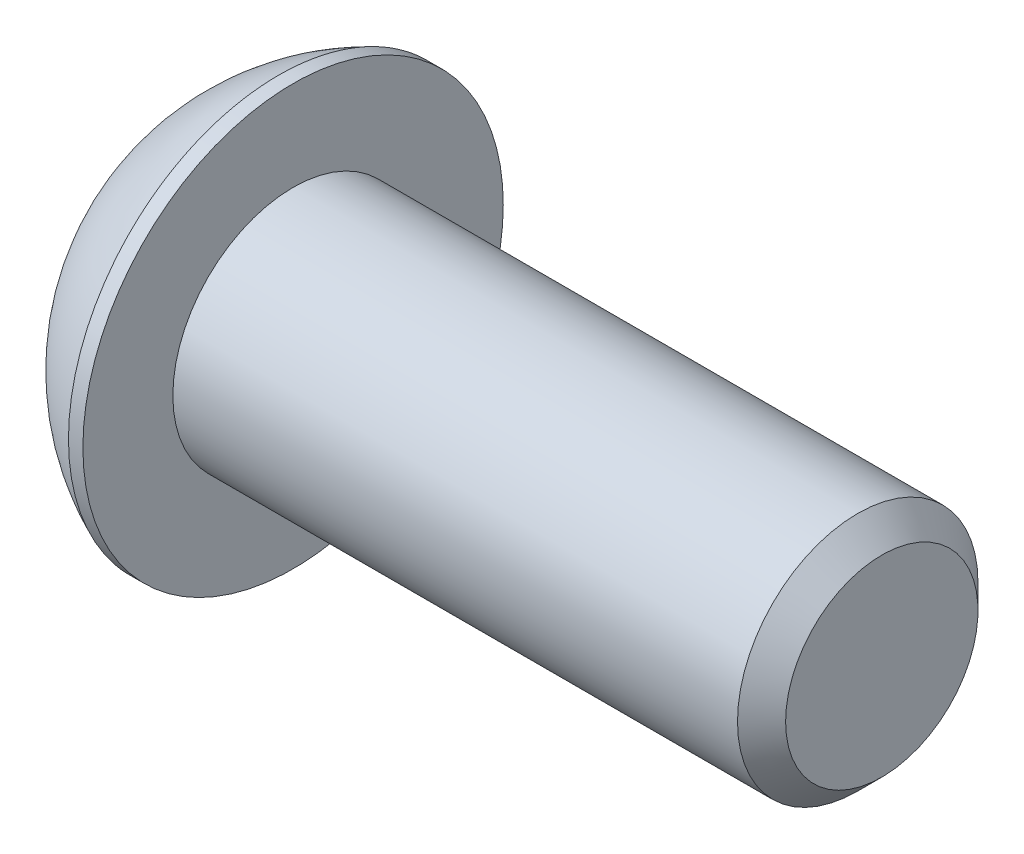
ISO-10303-21;
HEADER;
FILE_DESCRIPTION(('STEP AP214'),'2;1');
FILE_NAME('part.step','',(''),(''),'','','');
FILE_SCHEMA(('AUTOMOTIVE_DESIGN { 1 0 10303 214 1 1 1 1 }'));
ENDSEC;
DATA;
#1=APPLICATION_CONTEXT('core data for automotive mechanical design processes');
#2=APPLICATION_PROTOCOL_DEFINITION('international standard','automotive_design',2000,#1);
#3=PRODUCT_CONTEXT('',#1,'mechanical');
#4=PRODUCT('Part','Part','',(#3));
#5=PRODUCT_RELATED_PRODUCT_CATEGORY('part','',(#4));
#6=PRODUCT_DEFINITION_FORMATION('','',#4);
#7=PRODUCT_DEFINITION_CONTEXT('part definition',#1,'design');
#8=PRODUCT_DEFINITION('design','',#6,#7);
#9=PRODUCT_DEFINITION_SHAPE('','',#8);
#10=(LENGTH_UNIT() NAMED_UNIT(*) SI_UNIT(.MILLI.,.METRE.));
#11=(NAMED_UNIT(*) PLANE_ANGLE_UNIT() SI_UNIT($,.RADIAN.));
#12=(NAMED_UNIT(*) SI_UNIT($,.STERADIAN.) SOLID_ANGLE_UNIT());
#13=UNCERTAINTY_MEASURE_WITH_UNIT(LENGTH_MEASURE(1.E-05),#10,'distance_accuracy_value','');
#14=(GEOMETRIC_REPRESENTATION_CONTEXT(3) GLOBAL_UNCERTAINTY_ASSIGNED_CONTEXT((#13)) GLOBAL_UNIT_ASSIGNED_CONTEXT((#10,
#11,#12)) REPRESENTATION_CONTEXT('',''));
#15=CARTESIAN_POINT('',(0.,0.,0.));
#16=DIRECTION('',(0.,0.,1.));
#17=DIRECTION('',(1.,0.,0.));
#18=AXIS2_PLACEMENT_3D('',#15,#16,#17);
#19=CARTESIAN_POINT('',(1.32080000000034,0.,0.));
#20=DIRECTION('',(-1.,0.,0.));
#21=DIRECTION('',(0.,0.,1.));
#22=AXIS2_PLACEMENT_3D('',#19,#20,#21);
#23=CONICAL_SURFACE('',#22,1.1937999999998,1.04719755119608);
#24=CARTESIAN_POINT('',(2.01004075135902,0.,-4.44089209850063E-13));
#25=VERTEX_POINT('',#24);
#26=VERTEX_LOOP('',#25);
#27=FACE_BOUND('',#26,.T.);
#28=CARTESIAN_POINT('',(1.32080000000009,0.,0.));
#29=DIRECTION('',(-1.,0.,0.));
#30=DIRECTION('',(0.,0.,1.));
#31=AXIS2_PLACEMENT_3D('',#28,#29,#30);
#32=CIRCLE('',#31,1.19380000000024);
#33=CARTESIAN_POINT('',(1.32080000000009,0.,1.19380000000024));
#34=VERTEX_POINT('',#33);
#35=EDGE_CURVE('E20',#34,#34,#32,.T.);
#36=ORIENTED_EDGE('',*,*,#35,.T.);
#37=EDGE_LOOP('',(#36));
#38=FACE_BOUND('',#37,.T.);
#39=ADVANCED_FACE('F17',(#27,#38),#23,.F.);
#40=CARTESIAN_POINT('',(1.3208,-2.29135888084633,0.));
#41=DIRECTION('',(1.,0.,0.));
#42=DIRECTION('',(0.,0.,-1.));
#43=AXIS2_PLACEMENT_3D('',#40,#41,#42);
#44=PLANE('',#43);
#45=DIRECTION('',(0.,1.,0.));
#46=VECTOR('',#45,1.);
#47=CARTESIAN_POINT('',(1.3208,-1.14567944042316,1.984375));
#48=LINE('',#47,#46);
#49=CARTESIAN_POINT('',(1.3208,1.14567944042316,1.984375));
#50=VERTEX_POINT('',#49);
#51=CARTESIAN_POINT('',(1.3208,-1.14567944042316,1.984375));
#52=VERTEX_POINT('',#51);
#53=EDGE_CURVE('E69',#50,#52,#48,.F.);
#54=ORIENTED_EDGE('',*,*,#53,.F.);
#55=DIRECTION('',(0.,0.5,-0.866025403784439));
#56=VECTOR('',#55,1.);
#57=CARTESIAN_POINT('',(1.3208,1.14567944042316,1.984375));
#58=LINE('',#57,#56);
#59=CARTESIAN_POINT('',(1.3208,2.29135888084633,0.));
#60=VERTEX_POINT('',#59);
#61=EDGE_CURVE('E293',#60,#50,#58,.F.);
#62=ORIENTED_EDGE('',*,*,#61,.F.);
#63=DIRECTION('',(0.,-0.5,-0.866025403784439));
#64=VECTOR('',#63,1.);
#65=CARTESIAN_POINT('',(1.3208,2.29135888084633,0.));
#66=LINE('',#65,#64);
#67=CARTESIAN_POINT('',(1.3208,1.14567944042316,-1.984375));
#68=VERTEX_POINT('',#67);
#69=EDGE_CURVE('E297',#68,#60,#66,.F.);
#70=ORIENTED_EDGE('',*,*,#69,.F.);
#71=DIRECTION('',(0.,1.,0.));
#72=VECTOR('',#71,1.);
#73=CARTESIAN_POINT('',(1.3208,1.14567944042316,-1.984375));
#74=LINE('',#73,#72);
#75=CARTESIAN_POINT('',(1.3208,-1.14567944042316,-1.984375));
#76=VERTEX_POINT('',#75);
#77=EDGE_CURVE('E302',#76,#68,#74,.T.);
#78=ORIENTED_EDGE('',*,*,#77,.F.);
#79=DIRECTION('',(0.,-0.500000000000001,0.866025403784438));
#80=VECTOR('',#79,1.);
#81=CARTESIAN_POINT('',(1.3208,-1.14567944042316,-1.984375));
#82=LINE('',#81,#80);
#83=CARTESIAN_POINT('',(1.3208,-2.29135888084633,0.));
#84=VERTEX_POINT('',#83);
#85=EDGE_CURVE('E307',#84,#76,#82,.F.);
#86=ORIENTED_EDGE('',*,*,#85,.F.);
#87=DIRECTION('',(0.,0.500000000000001,0.866025403784438));
#88=VECTOR('',#87,1.);
#89=CARTESIAN_POINT('',(1.3208,-2.29135888084633,0.));
#90=LINE('',#89,#88);
#91=EDGE_CURVE('E82',#52,#84,#90,.F.);
#92=ORIENTED_EDGE('',*,*,#91,.F.);
#93=EDGE_LOOP('',(#54,#62,#70,#78,#86,#92));
#94=FACE_BOUND('',#93,.T.);
#95=ORIENTED_EDGE('',*,*,#35,.F.);
#96=EDGE_LOOP('',(#95));
#97=FACE_BOUND('',#96,.T.);
#98=ADVANCED_FACE('F75',(#94,#97),#44,.F.);
#99=CARTESIAN_POINT('',(1.3208,-1.14567944042316,1.984375));
#100=DIRECTION('',(0.,0.,-1.));
#101=DIRECTION('',(0.,1.,0.));
#102=AXIS2_PLACEMENT_3D('',#99,#100,#101);
#103=PLANE('',#102);
#104=ORIENTED_EDGE('',*,*,#53,.T.);
#105=DIRECTION('',(1.,0.,0.));
#106=VECTOR('',#105,1.);
#107=CARTESIAN_POINT('',(1.3208,-1.14567944042316,1.984375));
#108=LINE('',#107,#106);
#109=CARTESIAN_POINT('',(0.,-1.14567944042316,1.984375));
#110=VERTEX_POINT('',#109);
#111=EDGE_CURVE('E79',#110,#52,#108,.T.);
#112=ORIENTED_EDGE('',*,*,#111,.F.);
#113=DIRECTION('',(0.,1.,0.));
#114=VECTOR('',#113,1.);
#115=CARTESIAN_POINT('',(0.,0.,1.984375));
#116=LINE('',#115,#114);
#117=CARTESIAN_POINT('',(0.,1.14567944042316,1.984375));
#118=VERTEX_POINT('',#117);
#119=EDGE_CURVE('E287',#118,#110,#116,.F.);
#120=ORIENTED_EDGE('',*,*,#119,.F.);
#121=DIRECTION('',(1.,0.,0.));
#122=VECTOR('',#121,1.);
#123=CARTESIAN_POINT('',(1.3208,1.14567944042316,1.984375));
#124=LINE('',#123,#122);
#125=EDGE_CURVE('E290',#50,#118,#124,.F.);
#126=ORIENTED_EDGE('',*,*,#125,.F.);
#127=EDGE_LOOP('',(#104,#112,#120,#126));
#128=FACE_BOUND('',#127,.T.);
#129=ADVANCED_FACE('F129',(#128),#103,.T.);
#130=CARTESIAN_POINT('',(1.3208,-2.29135888084633,0.));
#131=DIRECTION('',(0.,0.866025403784438,-0.500000000000001));
#132=DIRECTION('',(0.,0.500000000000001,0.866025403784438));
#133=AXIS2_PLACEMENT_3D('',#130,#131,#132);
#134=PLANE('',#133);
#135=ORIENTED_EDGE('',*,*,#91,.T.);
#136=DIRECTION('',(1.,0.,0.));
#137=VECTOR('',#136,1.);
#138=CARTESIAN_POINT('',(1.3208,-2.29135888084633,0.));
#139=LINE('',#138,#137);
#140=CARTESIAN_POINT('',(0.,-2.29135888084633,0.));
#141=VERTEX_POINT('',#140);
#142=EDGE_CURVE('E309',#141,#84,#139,.T.);
#143=ORIENTED_EDGE('',*,*,#142,.F.);
#144=DIRECTION('',(0.,-0.500000000000001,-0.866025403784438));
#145=VECTOR('',#144,1.);
#146=CARTESIAN_POINT('',(0.,-1.14567944042316,1.984375));
#147=LINE('',#146,#145);
#148=EDGE_CURVE('E284',#110,#141,#147,.T.);
#149=ORIENTED_EDGE('',*,*,#148,.F.);
#150=ORIENTED_EDGE('',*,*,#111,.T.);
#151=EDGE_LOOP('',(#135,#143,#149,#150));
#152=FACE_BOUND('',#151,.T.);
#153=ADVANCED_FACE('F125',(#152),#134,.T.);
#154=CARTESIAN_POINT('',(1.3208,-1.14567944042316,-1.984375));
#155=DIRECTION('',(0.,0.866025403784438,0.500000000000001));
#156=DIRECTION('',(0.,-0.500000000000001,0.866025403784438));
#157=AXIS2_PLACEMENT_3D('',#154,#155,#156);
#158=PLANE('',#157);
#159=ORIENTED_EDGE('',*,*,#85,.T.);
#160=DIRECTION('',(1.,0.,0.));
#161=VECTOR('',#160,1.);
#162=CARTESIAN_POINT('',(1.3208,-1.14567944042316,-1.984375));
#163=LINE('',#162,#161);
#164=CARTESIAN_POINT('',(0.,-1.14567944042316,-1.984375));
#165=VERTEX_POINT('',#164);
#166=EDGE_CURVE('E304',#165,#76,#163,.T.);
#167=ORIENTED_EDGE('',*,*,#166,.F.);
#168=DIRECTION('',(0.,0.500000000000001,-0.866025403784438));
#169=VECTOR('',#168,1.);
#170=CARTESIAN_POINT('',(0.,-2.29135888084633,0.));
#171=LINE('',#170,#169);
#172=EDGE_CURVE('E281',#141,#165,#171,.T.);
#173=ORIENTED_EDGE('',*,*,#172,.F.);
#174=ORIENTED_EDGE('',*,*,#142,.T.);
#175=EDGE_LOOP('',(#159,#167,#173,#174));
#176=FACE_BOUND('',#175,.T.);
#177=ADVANCED_FACE('F121',(#176),#158,.T.);
#178=CARTESIAN_POINT('',(1.3208,1.14567944042316,-1.984375));
#179=DIRECTION('',(0.,0.,1.));
#180=DIRECTION('',(1.,0.,0.));
#181=AXIS2_PLACEMENT_3D('',#178,#179,#180);
#182=PLANE('',#181);
#183=ORIENTED_EDGE('',*,*,#77,.T.);
#184=DIRECTION('',(1.,0.,0.));
#185=VECTOR('',#184,1.);
#186=CARTESIAN_POINT('',(1.3208,1.14567944042316,-1.984375));
#187=LINE('',#186,#185);
#188=CARTESIAN_POINT('',(0.,1.14567944042316,-1.984375));
#189=VERTEX_POINT('',#188);
#190=EDGE_CURVE('E299',#189,#68,#187,.T.);
#191=ORIENTED_EDGE('',*,*,#190,.F.);
#192=DIRECTION('',(0.,1.,0.));
#193=VECTOR('',#192,1.);
#194=CARTESIAN_POINT('',(0.,0.,-1.984375));
#195=LINE('',#194,#193);
#196=EDGE_CURVE('E278',#165,#189,#195,.T.);
#197=ORIENTED_EDGE('',*,*,#196,.F.);
#198=ORIENTED_EDGE('',*,*,#166,.T.);
#199=EDGE_LOOP('',(#183,#191,#197,#198));
#200=FACE_BOUND('',#199,.T.);
#201=ADVANCED_FACE('F118',(#200),#182,.T.);
#202=CARTESIAN_POINT('',(1.3208,2.29135888084633,0.));
#203=DIRECTION('',(0.,-0.866025403784439,0.5));
#204=DIRECTION('',(0.,-0.5,-0.866025403784439));
#205=AXIS2_PLACEMENT_3D('',#202,#203,#204);
#206=PLANE('',#205);
#207=ORIENTED_EDGE('',*,*,#69,.T.);
#208=DIRECTION('',(1.,0.,0.));
#209=VECTOR('',#208,1.);
#210=CARTESIAN_POINT('',(1.3208,2.29135888084633,0.));
#211=LINE('',#210,#209);
#212=CARTESIAN_POINT('',(0.,2.29135888084633,0.));
#213=VERTEX_POINT('',#212);
#214=EDGE_CURVE('E35',#213,#60,#211,.T.);
#215=ORIENTED_EDGE('',*,*,#214,.F.);
#216=DIRECTION('',(0.,0.5,0.866025403784439));
#217=VECTOR('',#216,1.);
#218=CARTESIAN_POINT('',(0.,1.14567944042316,-1.984375));
#219=LINE('',#218,#217);
#220=EDGE_CURVE('E275',#189,#213,#219,.T.);
#221=ORIENTED_EDGE('',*,*,#220,.F.);
#222=ORIENTED_EDGE('',*,*,#190,.T.);
#223=EDGE_LOOP('',(#207,#215,#221,#222));
#224=FACE_BOUND('',#223,.T.);
#225=ADVANCED_FACE('F114',(#224),#206,.T.);
#226=CARTESIAN_POINT('',(1.3208,1.14567944042316,1.984375));
#227=DIRECTION('',(0.,-0.866025403784439,-0.5));
#228=DIRECTION('',(0.,0.5,-0.866025403784439));
#229=AXIS2_PLACEMENT_3D('',#226,#227,#228);
#230=PLANE('',#229);
#231=ORIENTED_EDGE('',*,*,#61,.T.);
#232=ORIENTED_EDGE('',*,*,#125,.T.);
#233=DIRECTION('',(0.,-0.5,0.866025403784438));
#234=VECTOR('',#233,1.);
#235=CARTESIAN_POINT('',(0.,2.29135888084633,0.));
#236=LINE('',#235,#234);
#237=EDGE_CURVE('E101',#213,#118,#236,.T.);
#238=ORIENTED_EDGE('',*,*,#237,.F.);
#239=ORIENTED_EDGE('',*,*,#214,.T.);
#240=EDGE_LOOP('',(#231,#232,#238,#239));
#241=FACE_BOUND('',#240,.T.);
#242=ADVANCED_FACE('F110',(#241),#230,.T.);
#243=CARTESIAN_POINT('',(0.,0.,0.));
#244=DIRECTION('',(-1.,0.,0.));
#245=DIRECTION('',(0.,0.,1.));
#246=AXIS2_PLACEMENT_3D('',#243,#244,#245);
#247=PLANE('',#246);
#248=ORIENTED_EDGE('',*,*,#220,.T.);
#249=ORIENTED_EDGE('',*,*,#237,.T.);
#250=ORIENTED_EDGE('',*,*,#119,.T.);
#251=ORIENTED_EDGE('',*,*,#148,.T.);
#252=ORIENTED_EDGE('',*,*,#172,.T.);
#253=ORIENTED_EDGE('',*,*,#196,.T.);
#254=EDGE_LOOP('',(#248,#249,#250,#251,#252,#253));
#255=FACE_BOUND('',#254,.T.);
#256=CARTESIAN_POINT('',(0.,2.77495,0.));
#257=CARTESIAN_POINT('',(0.,2.77494953309947,0.0779118937523459));
#258=CARTESIAN_POINT('',(0.,2.77166578388025,0.15583810591977));
#259=CARTESIAN_POINT('',(0.,2.75855213600204,0.311152012455904));
#260=CARTESIAN_POINT('',(0.,2.74872030471467,0.388539541019556));
#261=CARTESIAN_POINT('',(0.,2.72255472645676,0.542341518735717));
#262=CARTESIAN_POINT('',(-2.70414110576258E-13,2.70621065843663,0.618754223567578));
#263=CARTESIAN_POINT('',(2.71501725221868E-13,2.66713326915777,0.769973634286023));
#264=CARTESIAN_POINT('',(1.01274952524446E-12,2.64439476297869,0.844778983646282));
#265=CARTESIAN_POINT('',(1.81909959813207E-12,2.56690195943351,1.06566239301792));
#266=CARTESIAN_POINT('',(4.77081687541822E-13,2.50280672569928,1.20857954243987));
#267=CARTESIAN_POINT('',(-4.76232447128612E-13,2.35149826934097,1.48160874561538));
#268=CARTESIAN_POINT('',(0.,2.26428416790397,1.61172031233499));
#269=CARTESIAN_POINT('',(0.,2.1181093928834,1.79445660654268));
#270=CARTESIAN_POINT('',(0.,2.06678693791626,1.85333128513996));
#271=CARTESIAN_POINT('',(0.,1.95940522984449,1.96650727912792));
#272=CARTESIAN_POINT('',(0.,1.90335059143535,2.02081294920044));
#273=CARTESIAN_POINT('',(0.,1.78683891013963,2.12453280878582));
#274=CARTESIAN_POINT('',(0.,1.72637988450322,2.1739447713554));
#275=CARTESIAN_POINT('',(0.,1.60151968865711,2.26750481692908));
#276=CARTESIAN_POINT('',(0.,1.53711760864537,2.31165167810847));
#277=CARTESIAN_POINT('',(0.,1.33869902291632,2.43567242603944));
#278=CARTESIAN_POINT('',(0.,1.19934704110695,2.507235886628));
#279=CARTESIAN_POINT('',(0.,0.910681609121881,2.62590828672821));
#280=CARTESIAN_POINT('',(0.,0.761368265357398,2.67301748742278));
#281=CARTESIAN_POINT('',(0.,0.456932649466623,2.74151230664007));
#282=CARTESIAN_POINT('',(0.,0.301810346322584,2.76289778778721));
#283=CARTESIAN_POINT('',(0.,-0.00982263870895171,2.77931595661156));
#284=CARTESIAN_POINT('',(0.,-0.166333320596448,2.77434864428877));
#285=CARTESIAN_POINT('',(0.,-0.476280836814452,2.73822217653073));
#286=CARTESIAN_POINT('',(0.,-0.629717687555985,2.70706316096981));
#287=CARTESIAN_POINT('',(0.,-0.929254830044274,2.61937980771149));
#288=CARTESIAN_POINT('',(0.,-1.0753550434132,2.56285519909568));
#289=CARTESIAN_POINT('',(0.,-1.28570692598579,2.46037024128109));
#290=CARTESIAN_POINT('',(0.,-1.35439130022287,2.42323494812896));
#291=CARTESIAN_POINT('',(0.,-1.488391287199,2.34331277270256));
#292=CARTESIAN_POINT('',(0.,-1.55370767631787,2.30052720108831));
#293=CARTESIAN_POINT('',(0.,-1.68047292776594,2.20962421887055));
#294=CARTESIAN_POINT('',(0.,-1.7419235278682,2.16150923122348));
#295=CARTESIAN_POINT('',(0.,-1.86060297067992,2.06024311301283));
#296=CARTESIAN_POINT('',(0.,-1.91782768181715,2.0070871669763));
#297=CARTESIAN_POINT('',(0.,-2.08239462196651,1.8407220856554));
#298=CARTESIAN_POINT('',(0.,-2.18279764272601,1.72049499758422));
#299=CARTESIAN_POINT('',(0.,-2.36195754944063,1.46487629213018));
#300=CARTESIAN_POINT('',(0.,-2.44071525816758,1.32948525142807));
#301=CARTESIAN_POINT('',(0.,-2.54098882695274,1.11796734074395));
#302=CARTESIAN_POINT('',(0.,-2.57146177392727,1.04596540008347));
#303=CARTESIAN_POINT('',(0.,-2.62621251108999,0.899689259475764));
#304=CARTESIAN_POINT('',(0.,-2.65049531495563,0.825416953360952));
#305=CARTESIAN_POINT('',(0.,-2.69267708798766,0.675215808695207));
#306=CARTESIAN_POINT('',(0.,-2.71058613777937,0.599289789313092));
#307=CARTESIAN_POINT('',(0.,-2.73994710360127,0.446213628496932));
#308=CARTESIAN_POINT('',(0.,-2.75140092413871,0.369063855024788));
#309=CARTESIAN_POINT('',(0.,-2.76470470685522,0.24316208817343));
#310=CARTESIAN_POINT('',(0.,-2.76854547596618,0.194611672428577));
#311=CARTESIAN_POINT('',(0.,-2.77366826843264,0.0973760351839812));
#312=CARTESIAN_POINT('',(0.,-2.77495029178814,0.0486908136842395));
#313=CARTESIAN_POINT('',(0.,-2.77494953309947,-0.0779118937523475));
#314=CARTESIAN_POINT('',(0.,-2.77166578388025,-0.155838105919772));
#315=CARTESIAN_POINT('',(0.,-2.75855213600204,-0.311152012455906));
#316=CARTESIAN_POINT('',(0.,-2.74872030471467,-0.388539541019558));
#317=CARTESIAN_POINT('',(0.,-2.72255472645677,-0.542341518735719));
#318=CARTESIAN_POINT('',(-2.70149297926331E-13,-2.70621065843663,-0.61875422356758));
#319=CARTESIAN_POINT('',(2.712366972268E-13,-2.66713326915777,-0.769973634286024));
#320=CARTESIAN_POINT('',(1.0114146773846E-12,-2.64439476297869,-0.844778983646283));
#321=CARTESIAN_POINT('',(1.81656702958366E-12,-2.5669019594335,-1.06566239301792));
#322=CARTESIAN_POINT('',(4.7641829195856E-13,-2.50280672569928,-1.20857954243988));
#323=CARTESIAN_POINT('',(-4.75569026324205E-13,-2.35149826934097,-1.48160874561538));
#324=CARTESIAN_POINT('',(0.,-2.26428416790396,-1.61172031233499));
#325=CARTESIAN_POINT('',(0.,-2.1181093928834,-1.79445660654268));
#326=CARTESIAN_POINT('',(0.,-2.06678693791626,-1.85333128513997));
#327=CARTESIAN_POINT('',(0.,-1.95940522984449,-1.96650727912792));
#328=CARTESIAN_POINT('',(0.,-1.90335059143535,-2.02081294920044));
#329=CARTESIAN_POINT('',(0.,-1.78683891013963,-2.12453280878582));
#330=CARTESIAN_POINT('',(0.,-1.72637988450322,-2.1739447713554));
#331=CARTESIAN_POINT('',(0.,-1.60151968865711,-2.26750481692908));
#332=CARTESIAN_POINT('',(0.,-1.53711760864537,-2.31165167810847));
#333=CARTESIAN_POINT('',(0.,-1.33869902291632,-2.43567242603944));
#334=CARTESIAN_POINT('',(0.,-1.19934704110695,-2.507235886628));
#335=CARTESIAN_POINT('',(0.,-0.91068160912188,-2.62590828672821));
#336=CARTESIAN_POINT('',(0.,-0.761368265357396,-2.67301748742278));
#337=CARTESIAN_POINT('',(0.,-0.456932649466621,-2.74151230664007));
#338=CARTESIAN_POINT('',(0.,-0.301810346322582,-2.76289778778721));
#339=CARTESIAN_POINT('',(0.,0.00982263870895353,-2.77931595661156));
#340=CARTESIAN_POINT('',(0.,0.16633332059645,-2.77434864428876));
#341=CARTESIAN_POINT('',(0.,0.476280836814454,-2.73822217653073));
#342=CARTESIAN_POINT('',(0.,0.629717687555987,-2.70706316096981));
#343=CARTESIAN_POINT('',(0.,0.929254830044276,-2.6193798077115));
#344=CARTESIAN_POINT('',(0.,1.0753550434132,-2.56285519909568));
#345=CARTESIAN_POINT('',(0.,1.28570692598579,-2.46037024128109));
#346=CARTESIAN_POINT('',(0.,1.35439130022287,-2.42323494812896));
#347=CARTESIAN_POINT('',(0.,1.488391287199,-2.34331277270256));
#348=CARTESIAN_POINT('',(0.,1.55370767631787,-2.30052720108831));
#349=CARTESIAN_POINT('',(0.,1.68047292776594,-2.20962421887055));
#350=CARTESIAN_POINT('',(0.,1.7419235278682,-2.16150923122348));
#351=CARTESIAN_POINT('',(0.,1.86060297067992,-2.06024311301282));
#352=CARTESIAN_POINT('',(0.,1.91782768181716,-2.0070871669763));
#353=CARTESIAN_POINT('',(0.,2.08239462196651,-1.8407220856554));
#354=CARTESIAN_POINT('',(0.,2.18279764272601,-1.72049499758422));
#355=CARTESIAN_POINT('',(0.,2.36195754944063,-1.46487629213018));
#356=CARTESIAN_POINT('',(0.,2.44071525816757,-1.32948525142807));
#357=CARTESIAN_POINT('',(0.,2.54098882695273,-1.11796734074395));
#358=CARTESIAN_POINT('',(0.,2.57146177392727,-1.04596540008347));
#359=CARTESIAN_POINT('',(0.,2.62621251108999,-0.899689259475765));
#360=CARTESIAN_POINT('',(0.,2.65049531495563,-0.825416953360953));
#361=CARTESIAN_POINT('',(0.,2.69267708798766,-0.675215808695207));
#362=CARTESIAN_POINT('',(0.,2.71058613777936,-0.599289789313092));
#363=CARTESIAN_POINT('',(0.,2.73994710360127,-0.446213628496932));
#364=CARTESIAN_POINT('',(0.,2.75140092413871,-0.369063855024789));
#365=CARTESIAN_POINT('',(0.,2.76470470685522,-0.243162088173432));
#366=CARTESIAN_POINT('',(0.,2.76854547596618,-0.194611672428578));
#367=CARTESIAN_POINT('',(0.,2.77366826843264,-0.0973760351839823));
#368=CARTESIAN_POINT('',(0.,2.77495029178814,-0.0486908136842408));
#369=CARTESIAN_POINT('',(0.,2.77495,0.));
#370=B_SPLINE_CURVE_WITH_KNOTS('',3,(#256,#257,#258,#259,#260,#261,#262,#263,#264,#265,#266,
#267,#268,#269,#270,#271,#272,#273,#274,#275,#276,#277,#278,#279,#280,#281,#282,#283,#284,#285,
#286,#287,#288,#289,#290,#291,#292,#293,#294,#295,#296,#297,#298,#299,#300,#301,#302,#303,#304,
#305,#306,#307,#308,#309,#310,#311,#312,#313,#314,#315,#316,#317,#318,#319,#320,#321,#322,#323,
#324,#325,#326,#327,#328,#329,#330,#331,#332,#333,#334,#335,#336,#337,#338,#339,#340,#341,#342,
#343,#344,#345,#346,#347,#348,#349,#350,#351,#352,#353,#354,#355,#356,#357,#358,#359,#360,#361,
#362,#363,#364,#365,#366,#367,#368,#369),.UNSPECIFIED.,.T.,.F.,(4,2,2,2,2,2,2,2,2,2,2,2,2,2,2,2,
2,2,2,2,2,2,2,2,2,2,2,2,2,2,2,2,2,2,2,2,2,2,2,2,2,2,2,2,2,2,2,2,2,2,2,2,2,2,2,2,4),(0.,
0.233690856748162,0.467450716578751,0.701582538521471,0.935904756015414,1.40343220467667,
1.87097742791502,2.10505636898837,2.33890962270652,2.57286880998746,2.80688218486306,
3.27442101763127,3.74195485676357,4.20949119271389,4.67702752866417,5.14456136779641,
5.61210020056468,5.84611357544033,6.08007276272136,6.31392601643949,6.54800495751273,
7.01555018075072,7.48307762941212,7.71739984690652,7.95153166884955,8.18529152868023,
8.41898238542855,8.56502681353347,8.71107124163843,8.94476209838659,9.17852195821718,
9.4126537801599,9.64697599765384,10.1145034463151,10.5820486695534,10.8161276106268,
11.0499808643449,11.2839400516259,11.5179534265015,11.9854922592697,12.453026098402,
12.9205624343523,13.3880987703026,13.8556326094348,14.3231714422031,14.5571848170788,
14.7911440043598,15.0249972580779,15.2590761991512,15.7266214223891,16.1941488710506,
16.4284710885449,16.662602910488,16.8963627703186,17.130053627067,17.2760980551719,
17.4221424832769),.UNSPECIFIED.);
#371=CARTESIAN_POINT('',(0.,2.77495,0.));
#372=VERTEX_POINT('',#371);
#373=EDGE_CURVE('E94',#372,#372,#370,.T.);
#374=ORIENTED_EDGE('',*,*,#373,.F.);
#375=EDGE_LOOP('',(#374));
#376=FACE_BOUND('',#375,.T.);
#377=ADVANCED_FACE('F106',(#255,#376),#247,.T.);
#378=CARTESIAN_POINT('',(5.37260881410256,0.,0.));
#379=DIRECTION('',(0.,1.,0.));
#380=DIRECTION('',(1.,0.,0.));
#381=AXIS2_PLACEMENT_3D('',#378,#379,#380);
#382=SPHERICAL_SURFACE('',#381,6.04692260342999);
#383=CARTESIAN_POINT('',(2.9718,0.,0.));
#384=DIRECTION('',(-1.,0.,0.));
#385=DIRECTION('',(0.,0.,1.));
#386=AXIS2_PLACEMENT_3D('',#383,#384,#385);
#387=CIRCLE('',#386,5.5499);
#388=CARTESIAN_POINT('',(2.9718,0.,5.5499));
#389=VERTEX_POINT('',#388);
#390=EDGE_CURVE('E92',#389,#389,#387,.F.);
#391=ORIENTED_EDGE('',*,*,#390,.F.);
#392=EDGE_LOOP('',(#391));
#393=FACE_BOUND('',#392,.T.);
#394=ORIENTED_EDGE('',*,*,#373,.T.);
#395=EDGE_LOOP('',(#394));
#396=FACE_BOUND('',#395,.T.);
#397=ADVANCED_FACE('F102',(#393,#396),#382,.T.);
#398=CARTESIAN_POINT('',(18.8976,0.,0.));
#399=DIRECTION('',(-1.,0.,0.));
#400=DIRECTION('',(0.,0.,1.));
#401=AXIS2_PLACEMENT_3D('',#398,#399,#400);
#402=PLANE('',#401);
#403=CARTESIAN_POINT('',(18.8976000000025,0.,0.));
#404=DIRECTION('',(-1.,0.,0.));
#405=DIRECTION('',(0.,0.,1.));
#406=AXIS2_PLACEMENT_3D('',#403,#404,#405);
#407=CIRCLE('',#406,2.54000000001042);
#408=CARTESIAN_POINT('',(18.8976000000025,0.,2.54000000001042));
#409=VERTEX_POINT('',#408);
#410=EDGE_CURVE('E89',#409,#409,#407,.T.);
#411=ORIENTED_EDGE('',*,*,#410,.F.);
#412=EDGE_LOOP('',(#411));
#413=FACE_BOUND('',#412,.T.);
#414=ADVANCED_FACE('F155',(#413),#402,.F.);
#415=CARTESIAN_POINT('',(0.,0.,0.));
#416=DIRECTION('',(-1.,0.,0.));
#417=DIRECTION('',(0.,0.,1.));
#418=AXIS2_PLACEMENT_3D('',#415,#416,#417);
#419=CYLINDRICAL_SURFACE('',#418,5.5499);
#420=ORIENTED_EDGE('',*,*,#390,.T.);
#421=EDGE_LOOP('',(#420));
#422=FACE_BOUND('',#421,.T.);
#423=CARTESIAN_POINT('',(3.3528,0.,0.));
#424=DIRECTION('',(-1.,0.,0.));
#425=DIRECTION('',(0.,0.,1.));
#426=AXIS2_PLACEMENT_3D('',#423,#424,#425);
#427=CIRCLE('',#426,5.5499);
#428=CARTESIAN_POINT('',(3.3528,0.,5.5499));
#429=VERTEX_POINT('',#428);
#430=EDGE_CURVE('E86',#429,#429,#427,.T.);
#431=ORIENTED_EDGE('',*,*,#430,.T.);
#432=EDGE_LOOP('',(#431));
#433=FACE_BOUND('',#432,.T.);
#434=ADVANCED_FACE('F152',(#422,#433),#419,.T.);
#435=CARTESIAN_POINT('',(18.2626000001278,0.,0.));
#436=DIRECTION('',(-1.,0.,0.));
#437=DIRECTION('',(0.,0.,1.));
#438=AXIS2_PLACEMENT_3D('',#435,#436,#437);
#439=CONICAL_SURFACE('',#438,3.17499999988513,0.785398163397448);
#440=CARTESIAN_POINT('',(18.2626,0.,0.));
#441=DIRECTION('',(-1.,0.,0.));
#442=DIRECTION('',(0.,0.,1.));
#443=AXIS2_PLACEMENT_3D('',#440,#441,#442);
#444=CIRCLE('',#443,3.175);
#445=CARTESIAN_POINT('',(18.2626,0.,3.175));
#446=VERTEX_POINT('',#445);
#447=EDGE_CURVE('E26',#446,#446,#444,.T.);
#448=ORIENTED_EDGE('',*,*,#447,.F.);
#449=EDGE_LOOP('',(#448));
#450=FACE_BOUND('',#449,.T.);
#451=ORIENTED_EDGE('',*,*,#410,.T.);
#452=EDGE_LOOP('',(#451));
#453=FACE_BOUND('',#452,.T.);
#454=ADVANCED_FACE('F145',(#450,#453),#439,.T.);
#455=CARTESIAN_POINT('',(3.3528,3.175,0.));
#456=DIRECTION('',(-1.,0.,0.));
#457=DIRECTION('',(0.,0.,1.));
#458=AXIS2_PLACEMENT_3D('',#455,#456,#457);
#459=PLANE('',#458);
#460=CARTESIAN_POINT('',(3.3528,0.,0.));
#461=DIRECTION('',(-1.,0.,0.));
#462=DIRECTION('',(0.,0.,1.));
#463=AXIS2_PLACEMENT_3D('',#460,#461,#462);
#464=CIRCLE('',#463,3.175);
#465=CARTESIAN_POINT('',(3.3528,0.,3.175));
#466=VERTEX_POINT('',#465);
#467=EDGE_CURVE('E11',#466,#466,#464,.F.);
#468=ORIENTED_EDGE('',*,*,#467,.F.);
#469=EDGE_LOOP('',(#468));
#470=FACE_BOUND('',#469,.T.);
#471=ORIENTED_EDGE('',*,*,#430,.F.);
#472=EDGE_LOOP('',(#471));
#473=FACE_BOUND('',#472,.T.);
#474=ADVANCED_FACE('F139',(#470,#473),#459,.F.);
#475=CARTESIAN_POINT('',(0.,0.,0.));
#476=DIRECTION('',(-1.,0.,0.));
#477=DIRECTION('',(0.,0.,1.));
#478=AXIS2_PLACEMENT_3D('',#475,#476,#477);
#479=CYLINDRICAL_SURFACE('',#478,3.175);
#480=ORIENTED_EDGE('',*,*,#467,.T.);
#481=EDGE_LOOP('',(#480));
#482=FACE_BOUND('',#481,.T.);
#483=ORIENTED_EDGE('',*,*,#447,.T.);
#484=EDGE_LOOP('',(#483));
#485=FACE_BOUND('',#484,.T.);
#486=ADVANCED_FACE('F137',(#482,#485),#479,.T.);
#487=CLOSED_SHELL('',(#39,#98,#129,#153,#177,#201,#225,#242,#377,#397,#414,#434,#454,#474,#486));
#488=MANIFOLD_SOLID_BREP('B1',#487);
#489=ADVANCED_BREP_SHAPE_REPRESENTATION('',(#18,#488),#14);
#490=SHAPE_DEFINITION_REPRESENTATION(#9,#489);
ENDSEC;
END-ISO-10303-21;
